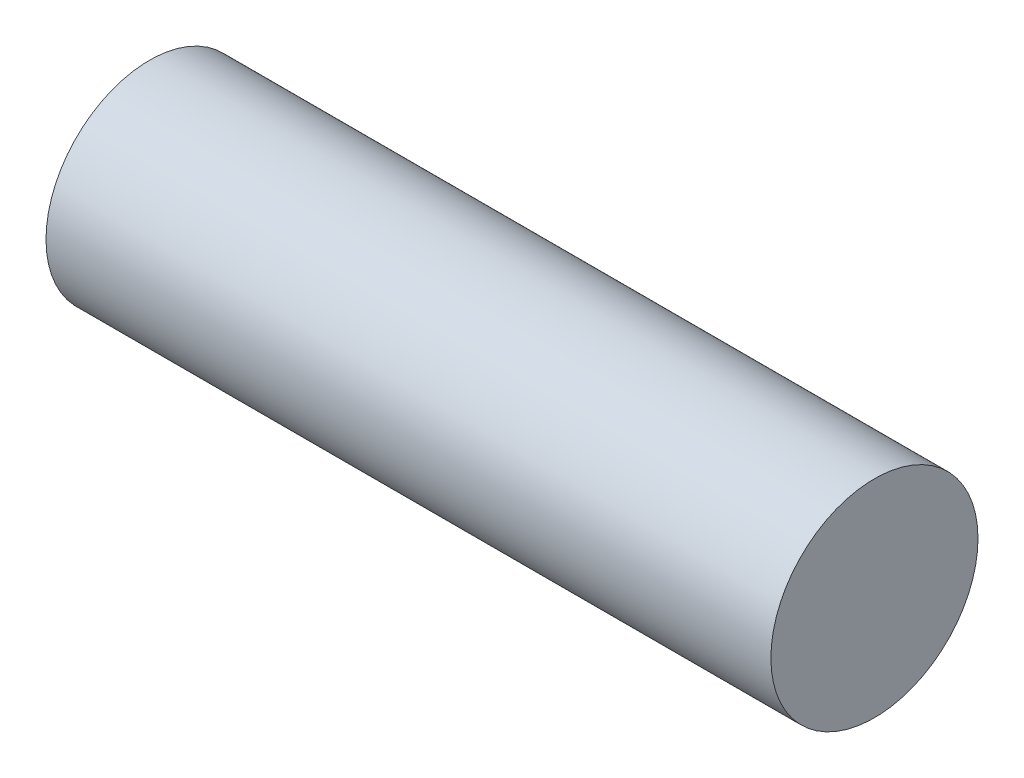
ISO-10303-21;
HEADER;
FILE_DESCRIPTION(('STEP AP214'),'2;1');
FILE_NAME('part.step','',(''),(''),'','','');
FILE_SCHEMA(('AUTOMOTIVE_DESIGN { 1 0 10303 214 1 1 1 1 }'));
ENDSEC;
DATA;
#1=APPLICATION_CONTEXT('core data for automotive mechanical design processes');
#2=APPLICATION_PROTOCOL_DEFINITION('international standard','automotive_design',2000,#1);
#3=PRODUCT_CONTEXT('',#1,'mechanical');
#4=PRODUCT('Part','Part','',(#3));
#5=PRODUCT_RELATED_PRODUCT_CATEGORY('part','',(#4));
#6=PRODUCT_DEFINITION_FORMATION('','',#4);
#7=PRODUCT_DEFINITION_CONTEXT('part definition',#1,'design');
#8=PRODUCT_DEFINITION('design','',#6,#7);
#9=PRODUCT_DEFINITION_SHAPE('','',#8);
#10=(LENGTH_UNIT() NAMED_UNIT(*) SI_UNIT(.MILLI.,.METRE.));
#11=(NAMED_UNIT(*) PLANE_ANGLE_UNIT() SI_UNIT($,.RADIAN.));
#12=(NAMED_UNIT(*) SI_UNIT($,.STERADIAN.) SOLID_ANGLE_UNIT());
#13=UNCERTAINTY_MEASURE_WITH_UNIT(LENGTH_MEASURE(1.E-05),#10,'distance_accuracy_value','');
#14=(GEOMETRIC_REPRESENTATION_CONTEXT(3) GLOBAL_UNCERTAINTY_ASSIGNED_CONTEXT((#13)) GLOBAL_UNIT_ASSIGNED_CONTEXT((#10,
#11,#12)) REPRESENTATION_CONTEXT('',''));
#15=CARTESIAN_POINT('',(0.,0.,0.));
#16=DIRECTION('',(0.,0.,1.));
#17=DIRECTION('',(1.,0.,0.));
#18=AXIS2_PLACEMENT_3D('',#15,#16,#17);
#19=CARTESIAN_POINT('',(70.,0.,0.));
#20=DIRECTION('',(-1.,0.,0.));
#21=DIRECTION('',(0.,0.,1.));
#22=AXIS2_PLACEMENT_3D('',#19,#20,#21);
#23=CYLINDRICAL_SURFACE('',#22,10.);
#24=CARTESIAN_POINT('',(70.,0.,0.));
#25=DIRECTION('',(1.,0.,0.));
#26=DIRECTION('',(0.,0.,-1.));
#27=AXIS2_PLACEMENT_3D('',#24,#25,#26);
#28=CIRCLE('',#27,10.);
#29=CARTESIAN_POINT('',(70.,0.,-10.));
#30=VERTEX_POINT('',#29);
#31=EDGE_CURVE('E10',#30,#30,#28,.T.);
#32=ORIENTED_EDGE('',*,*,#31,.F.);
#33=EDGE_LOOP('',(#32));
#34=FACE_BOUND('',#33,.T.);
#35=CARTESIAN_POINT('',(0.,0.,0.));
#36=DIRECTION('',(1.,0.,0.));
#37=DIRECTION('',(0.,0.,-1.));
#38=AXIS2_PLACEMENT_3D('',#35,#36,#37);
#39=CIRCLE('',#38,10.);
#40=CARTESIAN_POINT('',(0.,0.,-10.));
#41=VERTEX_POINT('',#40);
#42=EDGE_CURVE('E40',#41,#41,#39,.T.);
#43=ORIENTED_EDGE('',*,*,#42,.T.);
#44=EDGE_LOOP('',(#43));
#45=FACE_BOUND('',#44,.T.);
#46=ADVANCED_FACE('F37',(#34,#45),#23,.T.);
#47=CARTESIAN_POINT('',(70.,0.,0.));
#48=DIRECTION('',(1.,0.,0.));
#49=DIRECTION('',(0.,0.,-1.));
#50=AXIS2_PLACEMENT_3D('',#47,#48,#49);
#51=PLANE('',#50);
#52=ORIENTED_EDGE('',*,*,#31,.T.);
#53=EDGE_LOOP('',(#52));
#54=FACE_BOUND('',#53,.T.);
#55=ADVANCED_FACE('F54',(#54),#51,.T.);
#56=CARTESIAN_POINT('',(0.,0.,0.));
#57=DIRECTION('',(1.,0.,0.));
#58=DIRECTION('',(0.,0.,-1.));
#59=AXIS2_PLACEMENT_3D('',#56,#57,#58);
#60=PLANE('',#59);
#61=ORIENTED_EDGE('',*,*,#42,.F.);
#62=EDGE_LOOP('',(#61));
#63=FACE_BOUND('',#62,.T.);
#64=ADVANCED_FACE('F52',(#63),#60,.F.);
#65=CLOSED_SHELL('',(#46,#55,#64));
#66=MANIFOLD_SOLID_BREP('B2',#65);
#67=ADVANCED_BREP_SHAPE_REPRESENTATION('',(#18,#66),#14);
#68=SHAPE_DEFINITION_REPRESENTATION(#9,#67);
ENDSEC;
END-ISO-10303-21;
